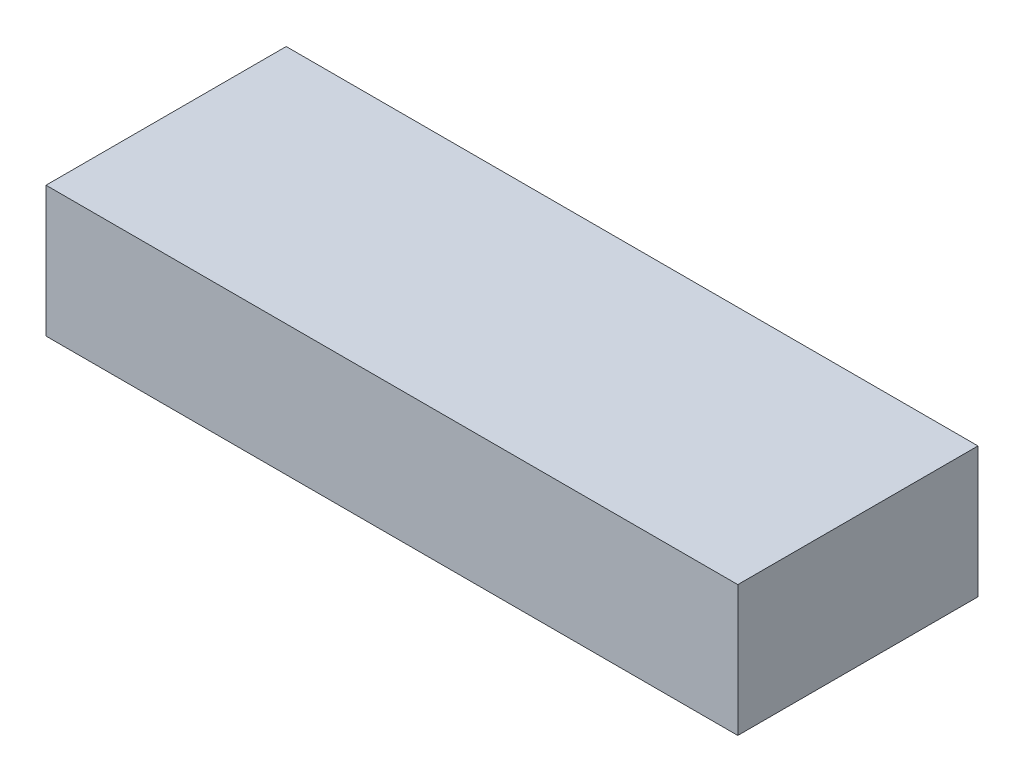
ISO-10303-21;
HEADER;
FILE_DESCRIPTION(('STEP AP214'),'2;1');
FILE_NAME('part.step','',(''),(''),'','','');
FILE_SCHEMA(('AUTOMOTIVE_DESIGN { 1 0 10303 214 1 1 1 1 }'));
ENDSEC;
DATA;
#1=APPLICATION_CONTEXT('core data for automotive mechanical design processes');
#2=APPLICATION_PROTOCOL_DEFINITION('international standard','automotive_design',2000,#1);
#3=PRODUCT_CONTEXT('',#1,'mechanical');
#4=PRODUCT('Part','Part','',(#3));
#5=PRODUCT_RELATED_PRODUCT_CATEGORY('part','',(#4));
#6=PRODUCT_DEFINITION_FORMATION('','',#4);
#7=PRODUCT_DEFINITION_CONTEXT('part definition',#1,'design');
#8=PRODUCT_DEFINITION('design','',#6,#7);
#9=PRODUCT_DEFINITION_SHAPE('','',#8);
#10=(LENGTH_UNIT() NAMED_UNIT(*) SI_UNIT(.MILLI.,.METRE.));
#11=(NAMED_UNIT(*) PLANE_ANGLE_UNIT() SI_UNIT($,.RADIAN.));
#12=(NAMED_UNIT(*) SI_UNIT($,.STERADIAN.) SOLID_ANGLE_UNIT());
#13=UNCERTAINTY_MEASURE_WITH_UNIT(LENGTH_MEASURE(1.E-05),#10,'distance_accuracy_value','');
#14=(GEOMETRIC_REPRESENTATION_CONTEXT(3) GLOBAL_UNCERTAINTY_ASSIGNED_CONTEXT((#13)) GLOBAL_UNIT_ASSIGNED_CONTEXT((#10,
#11,#12)) REPRESENTATION_CONTEXT('',''));
#15=CARTESIAN_POINT('',(0.,0.,0.));
#16=DIRECTION('',(0.,0.,1.));
#17=DIRECTION('',(1.,0.,0.));
#18=AXIS2_PLACEMENT_3D('',#15,#16,#17);
#19=CARTESIAN_POINT('',(36.,13.6,12.5));
#20=DIRECTION('',(-1.,0.,0.));
#21=DIRECTION('',(0.,0.,1.));
#22=AXIS2_PLACEMENT_3D('',#19,#20,#21);
#23=PLANE('',#22);
#24=DIRECTION('',(0.,0.,-1.));
#25=VECTOR('',#24,1.);
#26=CARTESIAN_POINT('',(36.,0.,12.5));
#27=LINE('',#26,#25);
#28=CARTESIAN_POINT('',(36.,0.,12.5));
#29=VERTEX_POINT('',#28);
#30=CARTESIAN_POINT('',(36.,0.,-12.5));
#31=VERTEX_POINT('',#30);
#32=EDGE_CURVE('E96',#29,#31,#27,.T.);
#33=ORIENTED_EDGE('',*,*,#32,.T.);
#34=DIRECTION('',(0.,-1.,0.));
#35=VECTOR('',#34,1.);
#36=CARTESIAN_POINT('',(36.,13.6,-12.5));
#37=LINE('',#36,#35);
#38=CARTESIAN_POINT('',(36.,13.6,-12.5));
#39=VERTEX_POINT('',#38);
#40=EDGE_CURVE('E11',#39,#31,#37,.T.);
#41=ORIENTED_EDGE('',*,*,#40,.F.);
#42=DIRECTION('',(0.,0.,-1.));
#43=VECTOR('',#42,1.);
#44=CARTESIAN_POINT('',(36.,13.6,12.5));
#45=LINE('',#44,#43);
#46=CARTESIAN_POINT('',(36.,13.6,12.5));
#47=VERTEX_POINT('',#46);
#48=EDGE_CURVE('E84',#47,#39,#45,.T.);
#49=ORIENTED_EDGE('',*,*,#48,.F.);
#50=DIRECTION('',(0.,-1.,0.));
#51=VECTOR('',#50,1.);
#52=CARTESIAN_POINT('',(36.,13.6,12.5));
#53=LINE('',#52,#51);
#54=EDGE_CURVE('E92',#47,#29,#53,.T.);
#55=ORIENTED_EDGE('',*,*,#54,.T.);
#56=EDGE_LOOP('',(#33,#41,#49,#55));
#57=FACE_BOUND('',#56,.T.);
#58=ADVANCED_FACE('F33',(#57),#23,.F.);
#59=CARTESIAN_POINT('',(-36.,13.6,-12.5));
#60=DIRECTION('',(0.,0.,1.));
#61=DIRECTION('',(1.,0.,0.));
#62=AXIS2_PLACEMENT_3D('',#59,#60,#61);
#63=PLANE('',#62);
#64=DIRECTION('',(-1.,0.,0.));
#65=VECTOR('',#64,1.);
#66=CARTESIAN_POINT('',(-36.,0.,-12.5));
#67=LINE('',#66,#65);
#68=CARTESIAN_POINT('',(-36.,0.,-12.5));
#69=VERTEX_POINT('',#68);
#70=EDGE_CURVE('E88',#31,#69,#67,.T.);
#71=ORIENTED_EDGE('',*,*,#70,.T.);
#72=DIRECTION('',(0.,-1.,0.));
#73=VECTOR('',#72,1.);
#74=CARTESIAN_POINT('',(-36.,13.6,-12.5));
#75=LINE('',#74,#73);
#76=CARTESIAN_POINT('',(-36.,13.6,-12.5));
#77=VERTEX_POINT('',#76);
#78=EDGE_CURVE('E41',#77,#69,#75,.T.);
#79=ORIENTED_EDGE('',*,*,#78,.F.);
#80=DIRECTION('',(-1.,0.,0.));
#81=VECTOR('',#80,1.);
#82=CARTESIAN_POINT('',(-36.,13.6,-12.5));
#83=LINE('',#82,#81);
#84=EDGE_CURVE('E79',#39,#77,#83,.T.);
#85=ORIENTED_EDGE('',*,*,#84,.F.);
#86=ORIENTED_EDGE('',*,*,#40,.T.);
#87=EDGE_LOOP('',(#71,#79,#85,#86));
#88=FACE_BOUND('',#87,.T.);
#89=ADVANCED_FACE('F87',(#88),#63,.F.);
#90=CARTESIAN_POINT('',(-36.,13.6,12.5));
#91=DIRECTION('',(1.,0.,0.));
#92=DIRECTION('',(0.,0.,-1.));
#93=AXIS2_PLACEMENT_3D('',#90,#91,#92);
#94=PLANE('',#93);
#95=DIRECTION('',(0.,0.,1.));
#96=VECTOR('',#95,1.);
#97=CARTESIAN_POINT('',(-36.,0.,12.5));
#98=LINE('',#97,#96);
#99=CARTESIAN_POINT('',(-36.,0.,12.5));
#100=VERTEX_POINT('',#99);
#101=EDGE_CURVE('E66',#69,#100,#98,.T.);
#102=ORIENTED_EDGE('',*,*,#101,.T.);
#103=DIRECTION('',(0.,-1.,0.));
#104=VECTOR('',#103,1.);
#105=CARTESIAN_POINT('',(-36.,13.6,12.5));
#106=LINE('',#105,#104);
#107=CARTESIAN_POINT('',(-36.,13.6,12.5));
#108=VERTEX_POINT('',#107);
#109=EDGE_CURVE('E89',#108,#100,#106,.T.);
#110=ORIENTED_EDGE('',*,*,#109,.F.);
#111=DIRECTION('',(0.,0.,1.));
#112=VECTOR('',#111,1.);
#113=CARTESIAN_POINT('',(-36.,13.6,12.5));
#114=LINE('',#113,#112);
#115=EDGE_CURVE('E82',#77,#108,#114,.T.);
#116=ORIENTED_EDGE('',*,*,#115,.F.);
#117=ORIENTED_EDGE('',*,*,#78,.T.);
#118=EDGE_LOOP('',(#102,#110,#116,#117));
#119=FACE_BOUND('',#118,.T.);
#120=ADVANCED_FACE('F90',(#119),#94,.F.);
#121=CARTESIAN_POINT('',(-36.,13.6,12.5));
#122=DIRECTION('',(0.,0.,-1.));
#123=DIRECTION('',(-1.,0.,0.));
#124=AXIS2_PLACEMENT_3D('',#121,#122,#123);
#125=PLANE('',#124);
#126=DIRECTION('',(1.,0.,0.));
#127=VECTOR('',#126,1.);
#128=CARTESIAN_POINT('',(-36.,0.,12.5));
#129=LINE('',#128,#127);
#130=EDGE_CURVE('E72',#100,#29,#129,.T.);
#131=ORIENTED_EDGE('',*,*,#130,.T.);
#132=ORIENTED_EDGE('',*,*,#54,.F.);
#133=DIRECTION('',(1.,0.,0.));
#134=VECTOR('',#133,1.);
#135=CARTESIAN_POINT('',(-36.,13.6,12.5));
#136=LINE('',#135,#134);
#137=EDGE_CURVE('E49',#108,#47,#136,.T.);
#138=ORIENTED_EDGE('',*,*,#137,.F.);
#139=ORIENTED_EDGE('',*,*,#109,.T.);
#140=EDGE_LOOP('',(#131,#132,#138,#139));
#141=FACE_BOUND('',#140,.T.);
#142=ADVANCED_FACE('F103',(#141),#125,.F.);
#143=CARTESIAN_POINT('',(0.,13.6,0.));
#144=DIRECTION('',(0.,-1.,0.));
#145=DIRECTION('',(0.,0.,-1.));
#146=AXIS2_PLACEMENT_3D('',#143,#144,#145);
#147=PLANE('',#146);
#148=ORIENTED_EDGE('',*,*,#48,.T.);
#149=ORIENTED_EDGE('',*,*,#84,.T.);
#150=ORIENTED_EDGE('',*,*,#115,.T.);
#151=ORIENTED_EDGE('',*,*,#137,.T.);
#152=EDGE_LOOP('',(#148,#149,#150,#151));
#153=FACE_BOUND('',#152,.T.);
#154=ADVANCED_FACE('F80',(#153),#147,.F.);
#155=CARTESIAN_POINT('',(0.,0.,0.));
#156=DIRECTION('',(0.,-1.,0.));
#157=DIRECTION('',(0.,0.,-1.));
#158=AXIS2_PLACEMENT_3D('',#155,#156,#157);
#159=PLANE('',#158);
#160=ORIENTED_EDGE('',*,*,#32,.F.);
#161=ORIENTED_EDGE('',*,*,#130,.F.);
#162=ORIENTED_EDGE('',*,*,#101,.F.);
#163=ORIENTED_EDGE('',*,*,#70,.F.);
#164=EDGE_LOOP('',(#160,#161,#162,#163));
#165=FACE_BOUND('',#164,.T.);
#166=ADVANCED_FACE('F106',(#165),#159,.T.);
#167=CLOSED_SHELL('',(#58,#89,#120,#142,#154,#166));
#168=MANIFOLD_SOLID_BREP('B2',#167);
#169=ADVANCED_BREP_SHAPE_REPRESENTATION('',(#18,#168),#14);
#170=SHAPE_DEFINITION_REPRESENTATION(#9,#169);
ENDSEC;
END-ISO-10303-21;
